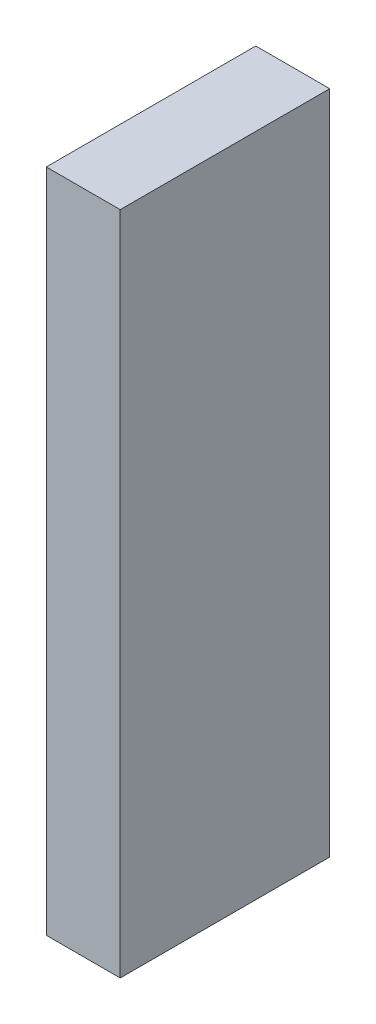
ISO-10303-21;
HEADER;
FILE_DESCRIPTION(('STEP AP214'),'2;1');
FILE_NAME('part.step','',(''),(''),'','','');
FILE_SCHEMA(('AUTOMOTIVE_DESIGN { 1 0 10303 214 1 1 1 1 }'));
ENDSEC;
DATA;
#1=APPLICATION_CONTEXT('core data for automotive mechanical design processes');
#2=APPLICATION_PROTOCOL_DEFINITION('international standard','automotive_design',2000,#1);
#3=PRODUCT_CONTEXT('',#1,'mechanical');
#4=PRODUCT('Part','Part','',(#3));
#5=PRODUCT_RELATED_PRODUCT_CATEGORY('part','',(#4));
#6=PRODUCT_DEFINITION_FORMATION('','',#4);
#7=PRODUCT_DEFINITION_CONTEXT('part definition',#1,'design');
#8=PRODUCT_DEFINITION('design','',#6,#7);
#9=PRODUCT_DEFINITION_SHAPE('','',#8);
#10=(LENGTH_UNIT() NAMED_UNIT(*) SI_UNIT(.MILLI.,.METRE.));
#11=(NAMED_UNIT(*) PLANE_ANGLE_UNIT() SI_UNIT($,.RADIAN.));
#12=(NAMED_UNIT(*) SI_UNIT($,.STERADIAN.) SOLID_ANGLE_UNIT());
#13=UNCERTAINTY_MEASURE_WITH_UNIT(LENGTH_MEASURE(1.E-05),#10,'distance_accuracy_value','');
#14=(GEOMETRIC_REPRESENTATION_CONTEXT(3) GLOBAL_UNCERTAINTY_ASSIGNED_CONTEXT((#13)) GLOBAL_UNIT_ASSIGNED_CONTEXT((#10,
#11,#12)) REPRESENTATION_CONTEXT('',''));
#15=CARTESIAN_POINT('',(0.,0.,0.));
#16=DIRECTION('',(0.,0.,1.));
#17=DIRECTION('',(1.,0.,0.));
#18=AXIS2_PLACEMENT_3D('',#15,#16,#17);
#19=CARTESIAN_POINT('',(-3.04999791303378,2.70000087133896,0.));
#20=DIRECTION('',(-1.,8.74227765734759E-08,0.));
#21=DIRECTION('',(-8.74227765734759E-08,-1.,0.));
#22=AXIS2_PLACEMENT_3D('',#19,#20,#21);
#23=PLANE('',#22);
#24=DIRECTION('',(-8.74227765512293E-08,-0.999999999999996,0.));
#25=VECTOR('',#24,1.);
#26=CARTESIAN_POINT('',(-3.04999791303378,2.70000087133896,0.));
#27=LINE('',#26,#25);
#28=CARTESIAN_POINT('',(-3.04999791303378,2.70000087133896,0.));
#29=VERTEX_POINT('',#28);
#30=CARTESIAN_POINT('',(-3.04999838511623,-2.69999302514542,0.));
#31=VERTEX_POINT('',#30);
#32=EDGE_CURVE('E11',#29,#31,#27,.T.);
#33=ORIENTED_EDGE('',*,*,#32,.T.);
#34=DIRECTION('',(0.,0.,1.));
#35=VECTOR('',#34,1.);
#36=CARTESIAN_POINT('',(-3.04999838511624,-2.69999302514542,0.));
#37=LINE('',#36,#35);
#38=CARTESIAN_POINT('',(-3.04999838511623,-2.69999302514542,1.6999990940094));
#39=VERTEX_POINT('',#38);
#40=EDGE_CURVE('E88',#31,#39,#37,.T.);
#41=ORIENTED_EDGE('',*,*,#40,.T.);
#42=DIRECTION('',(-8.74227765512293E-08,-0.999999999999996,0.));
#43=VECTOR('',#42,1.);
#44=CARTESIAN_POINT('',(-3.04999791303378,2.70000087133896,1.6999990940094));
#45=LINE('',#44,#43);
#46=CARTESIAN_POINT('',(-3.04999791303378,2.70000087133896,1.6999990940094));
#47=VERTEX_POINT('',#46);
#48=EDGE_CURVE('E83',#47,#39,#45,.T.);
#49=ORIENTED_EDGE('',*,*,#48,.F.);
#50=DIRECTION('',(0.,0.,1.));
#51=VECTOR('',#50,1.);
#52=CARTESIAN_POINT('',(-3.04999791303378,2.70000087133895,0.));
#53=LINE('',#52,#51);
#54=EDGE_CURVE('E72',#29,#47,#53,.T.);
#55=ORIENTED_EDGE('',*,*,#54,.F.);
#56=EDGE_LOOP('',(#33,#41,#49,#55));
#57=FACE_BOUND('',#56,.T.);
#58=ADVANCED_FACE('F17',(#57),#23,.T.);
#59=CARTESIAN_POINT('',(-3.04999838511623,-2.69999302514542,0.));
#60=DIRECTION('',(-8.74227765734759E-08,-1.,0.));
#61=DIRECTION('',(1.,-8.74227765734759E-08,0.));
#62=AXIS2_PLACEMENT_3D('',#59,#60,#61);
#63=PLANE('',#62);
#64=DIRECTION('',(0.999999999999996,-8.7422776708459E-08,0.));
#65=VECTOR('',#64,1.);
#66=CARTESIAN_POINT('',(-3.04999838511623,-2.69999302514542,0.));
#67=LINE('',#66,#65);
#68=CARTESIAN_POINT('',(-2.44999991099514,-2.69999307759896,0.));
#69=VERTEX_POINT('',#68);
#70=EDGE_CURVE('E24',#31,#69,#67,.T.);
#71=ORIENTED_EDGE('',*,*,#70,.T.);
#72=DIRECTION('',(0.,0.,1.));
#73=VECTOR('',#72,1.);
#74=CARTESIAN_POINT('',(-2.44999991099514,-2.69999307759895,0.));
#75=LINE('',#74,#73);
#76=CARTESIAN_POINT('',(-2.44999991099514,-2.69999307759896,1.6999990940094));
#77=VERTEX_POINT('',#76);
#78=EDGE_CURVE('E85',#69,#77,#75,.T.);
#79=ORIENTED_EDGE('',*,*,#78,.T.);
#80=DIRECTION('',(0.999999999999996,-8.7422776708459E-08,0.));
#81=VECTOR('',#80,1.);
#82=CARTESIAN_POINT('',(-3.04999838511623,-2.69999302514542,1.6999990940094));
#83=LINE('',#82,#81);
#84=EDGE_CURVE('E66',#39,#77,#83,.T.);
#85=ORIENTED_EDGE('',*,*,#84,.F.);
#86=ORIENTED_EDGE('',*,*,#40,.F.);
#87=EDGE_LOOP('',(#71,#79,#85,#86));
#88=FACE_BOUND('',#87,.T.);
#89=ADVANCED_FACE('F89',(#88),#63,.T.);
#90=CARTESIAN_POINT('',(-2.44999991099514,-2.69999307759896,0.));
#91=DIRECTION('',(1.,-8.74227765734759E-08,0.));
#92=DIRECTION('',(8.74227765734759E-08,1.,0.));
#93=AXIS2_PLACEMENT_3D('',#90,#91,#92);
#94=PLANE('',#93);
#95=DIRECTION('',(8.74227765512293E-08,0.999999999999996,0.));
#96=VECTOR('',#95,1.);
#97=CARTESIAN_POINT('',(-2.44999991099514,-2.69999307759896,0.));
#98=LINE('',#97,#96);
#99=CARTESIAN_POINT('',(-2.44999943891268,2.70000081888541,0.));
#100=VERTEX_POINT('',#99);
#101=EDGE_CURVE('E62',#69,#100,#98,.T.);
#102=ORIENTED_EDGE('',*,*,#101,.T.);
#103=DIRECTION('',(0.,0.,1.));
#104=VECTOR('',#103,1.);
#105=CARTESIAN_POINT('',(-2.44999943891268,2.70000081888541,0.));
#106=LINE('',#105,#104);
#107=CARTESIAN_POINT('',(-2.44999943891268,2.70000081888541,1.6999990940094));
#108=VERTEX_POINT('',#107);
#109=EDGE_CURVE('E55',#100,#108,#106,.T.);
#110=ORIENTED_EDGE('',*,*,#109,.T.);
#111=DIRECTION('',(8.74227765512293E-08,0.999999999999996,0.));
#112=VECTOR('',#111,1.);
#113=CARTESIAN_POINT('',(-2.44999991099514,-2.69999307759896,1.6999990940094));
#114=LINE('',#113,#112);
#115=EDGE_CURVE('E59',#77,#108,#114,.T.);
#116=ORIENTED_EDGE('',*,*,#115,.F.);
#117=ORIENTED_EDGE('',*,*,#78,.F.);
#118=EDGE_LOOP('',(#102,#110,#116,#117));
#119=FACE_BOUND('',#118,.T.);
#120=ADVANCED_FACE('F57',(#119),#94,.T.);
#121=CARTESIAN_POINT('',(-2.44999943891268,2.70000081888541,0.));
#122=DIRECTION('',(8.74227765734759E-08,1.,0.));
#123=DIRECTION('',(-1.,8.74227765734759E-08,0.));
#124=AXIS2_PLACEMENT_3D('',#121,#122,#123);
#125=PLANE('',#124);
#126=DIRECTION('',(-0.999999999999996,8.7422776708459E-08,0.));
#127=VECTOR('',#126,1.);
#128=CARTESIAN_POINT('',(-2.44999943891268,2.70000081888541,0.));
#129=LINE('',#128,#127);
#130=EDGE_CURVE('E65',#100,#29,#129,.T.);
#131=ORIENTED_EDGE('',*,*,#130,.T.);
#132=ORIENTED_EDGE('',*,*,#54,.T.);
#133=DIRECTION('',(-0.999999999999996,8.7422776708459E-08,0.));
#134=VECTOR('',#133,1.);
#135=CARTESIAN_POINT('',(-2.44999943891268,2.70000081888541,1.6999990940094));
#136=LINE('',#135,#134);
#137=EDGE_CURVE('E70',#108,#47,#136,.T.);
#138=ORIENTED_EDGE('',*,*,#137,.F.);
#139=ORIENTED_EDGE('',*,*,#109,.F.);
#140=EDGE_LOOP('',(#131,#132,#138,#139));
#141=FACE_BOUND('',#140,.T.);
#142=ADVANCED_FACE('F71',(#141),#125,.T.);
#143=CARTESIAN_POINT('',(41.8250045776367,74.8249969482422,1.6999990940094));
#144=DIRECTION('',(0.,0.,1.));
#145=DIRECTION('',(-1.,8.74227765734759E-08,0.));
#146=AXIS2_PLACEMENT_3D('',#143,#144,#145);
#147=PLANE('',#146);
#148=ORIENTED_EDGE('',*,*,#48,.T.);
#149=ORIENTED_EDGE('',*,*,#84,.T.);
#150=ORIENTED_EDGE('',*,*,#115,.T.);
#151=ORIENTED_EDGE('',*,*,#137,.T.);
#152=EDGE_LOOP('',(#148,#149,#150,#151));
#153=FACE_BOUND('',#152,.T.);
#154=ADVANCED_FACE('F76',(#153),#147,.T.);
#155=CARTESIAN_POINT('',(41.8250045776367,74.8249969482422,0.));
#156=DIRECTION('',(0.,0.,1.));
#157=DIRECTION('',(-1.,8.74227765734759E-08,0.));
#158=AXIS2_PLACEMENT_3D('',#155,#156,#157);
#159=PLANE('',#158);
#160=ORIENTED_EDGE('',*,*,#130,.F.);
#161=ORIENTED_EDGE('',*,*,#101,.F.);
#162=ORIENTED_EDGE('',*,*,#70,.F.);
#163=ORIENTED_EDGE('',*,*,#32,.F.);
#164=EDGE_LOOP('',(#160,#161,#162,#163));
#165=FACE_BOUND('',#164,.T.);
#166=ADVANCED_FACE('F91',(#165),#159,.F.);
#167=CLOSED_SHELL('',(#58,#89,#120,#142,#154,#166));
#168=MANIFOLD_SOLID_BREP('B1',#167);
#169=ADVANCED_BREP_SHAPE_REPRESENTATION('',(#18,#168),#14);
#170=SHAPE_DEFINITION_REPRESENTATION(#9,#169);
ENDSEC;
END-ISO-10303-21;
